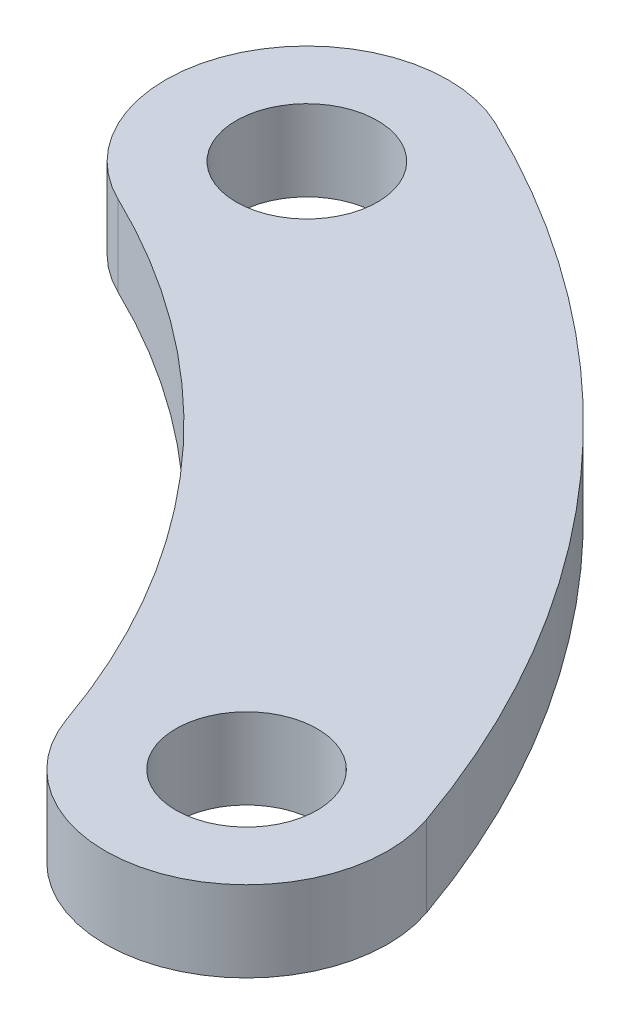
ISO-10303-21;
HEADER;
FILE_DESCRIPTION(('STEP AP214'),'2;1');
FILE_NAME('part.step','',(''),(''),'','','');
FILE_SCHEMA(('AUTOMOTIVE_DESIGN { 1 0 10303 214 1 1 1 1 }'));
ENDSEC;
DATA;
#1=APPLICATION_CONTEXT('core data for automotive mechanical design processes');
#2=APPLICATION_PROTOCOL_DEFINITION('international standard','automotive_design',2000,#1);
#3=PRODUCT_CONTEXT('',#1,'mechanical');
#4=PRODUCT('Part','Part','',(#3));
#5=PRODUCT_RELATED_PRODUCT_CATEGORY('part','',(#4));
#6=PRODUCT_DEFINITION_FORMATION('','',#4);
#7=PRODUCT_DEFINITION_CONTEXT('part definition',#1,'design');
#8=PRODUCT_DEFINITION('design','',#6,#7);
#9=PRODUCT_DEFINITION_SHAPE('','',#8);
#10=(LENGTH_UNIT() NAMED_UNIT(*) SI_UNIT(.MILLI.,.METRE.));
#11=(NAMED_UNIT(*) PLANE_ANGLE_UNIT() SI_UNIT($,.RADIAN.));
#12=(NAMED_UNIT(*) SI_UNIT($,.STERADIAN.) SOLID_ANGLE_UNIT());
#13=UNCERTAINTY_MEASURE_WITH_UNIT(LENGTH_MEASURE(1.E-05),#10,'distance_accuracy_value','');
#14=(GEOMETRIC_REPRESENTATION_CONTEXT(3) GLOBAL_UNCERTAINTY_ASSIGNED_CONTEXT((#13)) GLOBAL_UNIT_ASSIGNED_CONTEXT((#10,
#11,#12)) REPRESENTATION_CONTEXT('',''));
#15=CARTESIAN_POINT('',(0.,0.,0.));
#16=DIRECTION('',(0.,0.,1.));
#17=DIRECTION('',(1.,0.,0.));
#18=AXIS2_PLACEMENT_3D('',#15,#16,#17);
#19=CARTESIAN_POINT('',(11.4017185215984,4.,-3.97573134834832));
#20=DIRECTION('',(0.,1.,0.));
#21=DIRECTION('',(0.,0.,1.));
#22=AXIS2_PLACEMENT_3D('',#19,#20,#21);
#23=PLANE('',#22);
#24=CARTESIAN_POINT('',(10.5019317744189,4.,-21.7469981607911));
#25=DIRECTION('',(0.,1.,0.));
#26=DIRECTION('',(0.,0.,1.));
#27=AXIS2_PLACEMENT_3D('',#24,#25,#26);
#28=CIRCLE('',#27,1.75);
#29=CARTESIAN_POINT('',(10.5019317744189,4.,-19.9969981607911));
#30=VERTEX_POINT('',#29);
#31=EDGE_CURVE('E114',#30,#30,#28,.T.);
#32=ORIENTED_EDGE('',*,*,#31,.F.);
#33=EDGE_LOOP('',(#32));
#34=FACE_BOUND('',#33,.T.);
#35=CARTESIAN_POINT('',(22.8034370431968,4.,-7.95146269669664));
#36=DIRECTION('',(0.,1.,0.));
#37=DIRECTION('',(0.,0.,1.));
#38=AXIS2_PLACEMENT_3D('',#35,#36,#37);
#39=CIRCLE('',#38,3.5);
#40=CARTESIAN_POINT('',(19.4985910949074,4.,-6.79907679862466));
#41=VERTEX_POINT('',#40);
#42=CARTESIAN_POINT('',(26.1082829914862,4.,-9.10384859476862));
#43=VERTEX_POINT('',#42);
#44=EDGE_CURVE('E94',#41,#43,#39,.T.);
#45=ORIENTED_EDGE('',*,*,#44,.T.);
#46=CARTESIAN_POINT('',(0.,4.,0.));
#47=DIRECTION('',(0.,1.,0.));
#48=DIRECTION('',(0.,0.,1.));
#49=AXIS2_PLACEMENT_3D('',#46,#47,#48);
#50=CIRCLE('',#49,27.65);
#51=CARTESIAN_POINT('',(12.0239508721608,4.,-24.8987370246738));
#52=VERTEX_POINT('',#51);
#53=EDGE_CURVE('E89',#43,#52,#50,.T.);
#54=ORIENTED_EDGE('',*,*,#53,.T.);
#55=CARTESIAN_POINT('',(10.5019317744189,4.,-21.7469981607911));
#56=DIRECTION('',(0.,1.,0.));
#57=DIRECTION('',(0.,0.,1.));
#58=AXIS2_PLACEMENT_3D('',#55,#56,#57);
#59=CIRCLE('',#58,3.5);
#60=CARTESIAN_POINT('',(8.97991267667702,4.,-18.5952592969083));
#61=VERTEX_POINT('',#60);
#62=EDGE_CURVE('E92',#52,#61,#59,.T.);
#63=ORIENTED_EDGE('',*,*,#62,.T.);
#64=CARTESIAN_POINT('',(0.,4.,0.));
#65=DIRECTION('',(0.,-1.,0.));
#66=DIRECTION('',(0.,0.,1.));
#67=AXIS2_PLACEMENT_3D('',#64,#65,#66);
#68=CIRCLE('',#67,20.65);
#69=EDGE_CURVE('E59',#61,#41,#68,.T.);
#70=ORIENTED_EDGE('',*,*,#69,.T.);
#71=EDGE_LOOP('',(#45,#54,#63,#70));
#72=FACE_BOUND('',#71,.T.);
#73=CARTESIAN_POINT('',(22.8034370431968,4.,-7.95146269669664));
#74=DIRECTION('',(0.,1.,0.));
#75=DIRECTION('',(0.,0.,1.));
#76=AXIS2_PLACEMENT_3D('',#73,#74,#75);
#77=CIRCLE('',#76,1.75);
#78=CARTESIAN_POINT('',(22.8034370431968,4.,-6.20146269669664));
#79=VERTEX_POINT('',#78);
#80=EDGE_CURVE('E136',#79,#79,#77,.T.);
#81=ORIENTED_EDGE('',*,*,#80,.F.);
#82=EDGE_LOOP('',(#81));
#83=FACE_BOUND('',#82,.T.);
#84=ADVANCED_FACE('F41',(#34,#72,#83),#23,.T.);
#85=CARTESIAN_POINT('',(11.4017185215984,2.,-3.97573134834832));
#86=DIRECTION('',(0.,1.,0.));
#87=DIRECTION('',(0.,0.,1.));
#88=AXIS2_PLACEMENT_3D('',#85,#86,#87);
#89=PLANE('',#88);
#90=CARTESIAN_POINT('',(22.8034370431968,2.,-7.95146269669664));
#91=DIRECTION('',(0.,1.,0.));
#92=DIRECTION('',(0.,0.,1.));
#93=AXIS2_PLACEMENT_3D('',#90,#91,#92);
#94=CIRCLE('',#93,3.5);
#95=CARTESIAN_POINT('',(19.4985910949074,2.,-6.79907679862466));
#96=VERTEX_POINT('',#95);
#97=CARTESIAN_POINT('',(26.1082829914862,2.,-9.10384859476862));
#98=VERTEX_POINT('',#97);
#99=EDGE_CURVE('E110',#96,#98,#94,.T.);
#100=ORIENTED_EDGE('',*,*,#99,.F.);
#101=CARTESIAN_POINT('',(0.,2.,0.));
#102=DIRECTION('',(0.,-1.,0.));
#103=DIRECTION('',(0.,0.,1.));
#104=AXIS2_PLACEMENT_3D('',#101,#102,#103);
#105=CIRCLE('',#104,20.65);
#106=CARTESIAN_POINT('',(8.97991267667702,2.,-18.5952592969083));
#107=VERTEX_POINT('',#106);
#108=EDGE_CURVE('E82',#107,#96,#105,.T.);
#109=ORIENTED_EDGE('',*,*,#108,.F.);
#110=CARTESIAN_POINT('',(10.5019317744189,2.,-21.7469981607911));
#111=DIRECTION('',(0.,1.,0.));
#112=DIRECTION('',(0.,0.,1.));
#113=AXIS2_PLACEMENT_3D('',#110,#111,#112);
#114=CIRCLE('',#113,3.5);
#115=CARTESIAN_POINT('',(12.0239508721608,2.,-24.8987370246738));
#116=VERTEX_POINT('',#115);
#117=EDGE_CURVE('E76',#116,#107,#114,.T.);
#118=ORIENTED_EDGE('',*,*,#117,.F.);
#119=CARTESIAN_POINT('',(0.,2.,0.));
#120=DIRECTION('',(0.,1.,0.));
#121=DIRECTION('',(0.,0.,1.));
#122=AXIS2_PLACEMENT_3D('',#119,#120,#121);
#123=CIRCLE('',#122,27.65);
#124=EDGE_CURVE('E99',#98,#116,#123,.T.);
#125=ORIENTED_EDGE('',*,*,#124,.F.);
#126=EDGE_LOOP('',(#100,#109,#118,#125));
#127=FACE_BOUND('',#126,.T.);
#128=CARTESIAN_POINT('',(10.5019317744189,2.,-21.7469981607911));
#129=DIRECTION('',(0.,1.,0.));
#130=DIRECTION('',(0.,0.,1.));
#131=AXIS2_PLACEMENT_3D('',#128,#129,#130);
#132=CIRCLE('',#131,1.75);
#133=CARTESIAN_POINT('',(10.5019317744189,2.,-19.9969981607911));
#134=VERTEX_POINT('',#133);
#135=EDGE_CURVE('E132',#134,#134,#132,.T.);
#136=ORIENTED_EDGE('',*,*,#135,.T.);
#137=EDGE_LOOP('',(#136));
#138=FACE_BOUND('',#137,.T.);
#139=CARTESIAN_POINT('',(22.8034370431968,2.,-7.95146269669664));
#140=DIRECTION('',(0.,1.,0.));
#141=DIRECTION('',(0.,0.,1.));
#142=AXIS2_PLACEMENT_3D('',#139,#140,#141);
#143=CIRCLE('',#142,1.75);
#144=CARTESIAN_POINT('',(22.8034370431968,2.,-6.20146269669664));
#145=VERTEX_POINT('',#144);
#146=EDGE_CURVE('E140',#145,#145,#143,.T.);
#147=ORIENTED_EDGE('',*,*,#146,.T.);
#148=EDGE_LOOP('',(#147));
#149=FACE_BOUND('',#148,.T.);
#150=ADVANCED_FACE('F127',(#127,#138,#149),#89,.F.);
#151=CARTESIAN_POINT('',(22.8034370431968,4.,-7.95146269669664));
#152=DIRECTION('',(0.,-1.,0.));
#153=DIRECTION('',(0.,0.,-1.));
#154=AXIS2_PLACEMENT_3D('',#151,#152,#153);
#155=CYLINDRICAL_SURFACE('',#154,3.5);
#156=ORIENTED_EDGE('',*,*,#99,.T.);
#157=DIRECTION('',(0.,-1.,0.));
#158=VECTOR('',#157,1.);
#159=CARTESIAN_POINT('',(26.1082829914862,4.,-9.10384859476862));
#160=LINE('',#159,#158);
#161=EDGE_CURVE('E11',#43,#98,#160,.T.);
#162=ORIENTED_EDGE('',*,*,#161,.F.);
#163=ORIENTED_EDGE('',*,*,#44,.F.);
#164=DIRECTION('',(0.,-1.,0.));
#165=VECTOR('',#164,1.);
#166=CARTESIAN_POINT('',(19.4985910949074,4.,-6.79907679862466));
#167=LINE('',#166,#165);
#168=EDGE_CURVE('E106',#41,#96,#167,.T.);
#169=ORIENTED_EDGE('',*,*,#168,.T.);
#170=EDGE_LOOP('',(#156,#162,#163,#169));
#171=FACE_BOUND('',#170,.T.);
#172=ADVANCED_FACE('F43',(#171),#155,.T.);
#173=CARTESIAN_POINT('',(0.,4.,0.));
#174=DIRECTION('',(0.,-1.,0.));
#175=DIRECTION('',(0.,0.,-1.));
#176=AXIS2_PLACEMENT_3D('',#173,#174,#175);
#177=CYLINDRICAL_SURFACE('',#176,27.65);
#178=ORIENTED_EDGE('',*,*,#124,.T.);
#179=DIRECTION('',(0.,-1.,0.));
#180=VECTOR('',#179,1.);
#181=CARTESIAN_POINT('',(12.0239508721608,4.,-24.8987370246738));
#182=LINE('',#181,#180);
#183=EDGE_CURVE('E51',#52,#116,#182,.T.);
#184=ORIENTED_EDGE('',*,*,#183,.F.);
#185=ORIENTED_EDGE('',*,*,#53,.F.);
#186=ORIENTED_EDGE('',*,*,#161,.T.);
#187=EDGE_LOOP('',(#178,#184,#185,#186));
#188=FACE_BOUND('',#187,.T.);
#189=ADVANCED_FACE('F98',(#188),#177,.T.);
#190=CARTESIAN_POINT('',(10.5019317744189,4.,-21.7469981607911));
#191=DIRECTION('',(0.,-1.,0.));
#192=DIRECTION('',(0.,0.,-1.));
#193=AXIS2_PLACEMENT_3D('',#190,#191,#192);
#194=CYLINDRICAL_SURFACE('',#193,3.5);
#195=ORIENTED_EDGE('',*,*,#117,.T.);
#196=DIRECTION('',(0.,-1.,0.));
#197=VECTOR('',#196,1.);
#198=CARTESIAN_POINT('',(8.97991267667702,4.,-18.5952592969083));
#199=LINE('',#198,#197);
#200=EDGE_CURVE('E101',#61,#107,#199,.T.);
#201=ORIENTED_EDGE('',*,*,#200,.F.);
#202=ORIENTED_EDGE('',*,*,#62,.F.);
#203=ORIENTED_EDGE('',*,*,#183,.T.);
#204=EDGE_LOOP('',(#195,#201,#202,#203));
#205=FACE_BOUND('',#204,.T.);
#206=ADVANCED_FACE('F102',(#205),#194,.T.);
#207=CARTESIAN_POINT('',(0.,4.,0.));
#208=DIRECTION('',(0.,-1.,0.));
#209=DIRECTION('',(0.,0.,-1.));
#210=AXIS2_PLACEMENT_3D('',#207,#208,#209);
#211=CYLINDRICAL_SURFACE('',#210,20.65);
#212=ORIENTED_EDGE('',*,*,#108,.T.);
#213=ORIENTED_EDGE('',*,*,#168,.F.);
#214=ORIENTED_EDGE('',*,*,#69,.F.);
#215=ORIENTED_EDGE('',*,*,#200,.T.);
#216=EDGE_LOOP('',(#212,#213,#214,#215));
#217=FACE_BOUND('',#216,.T.);
#218=ADVANCED_FACE('F124',(#217),#211,.F.);
#219=CARTESIAN_POINT('',(10.5019317744189,4.,-21.7469981607911));
#220=DIRECTION('',(0.,-1.,0.));
#221=DIRECTION('',(0.,0.,-1.));
#222=AXIS2_PLACEMENT_3D('',#219,#220,#221);
#223=CYLINDRICAL_SURFACE('',#222,1.75);
#224=ORIENTED_EDGE('',*,*,#31,.T.);
#225=EDGE_LOOP('',(#224));
#226=FACE_BOUND('',#225,.T.);
#227=ORIENTED_EDGE('',*,*,#135,.F.);
#228=EDGE_LOOP('',(#227));
#229=FACE_BOUND('',#228,.T.);
#230=ADVANCED_FACE('F159',(#226,#229),#223,.F.);
#231=CARTESIAN_POINT('',(22.8034370431968,4.,-7.95146269669664));
#232=DIRECTION('',(0.,-1.,0.));
#233=DIRECTION('',(0.,0.,-1.));
#234=AXIS2_PLACEMENT_3D('',#231,#232,#233);
#235=CYLINDRICAL_SURFACE('',#234,1.75);
#236=ORIENTED_EDGE('',*,*,#80,.T.);
#237=EDGE_LOOP('',(#236));
#238=FACE_BOUND('',#237,.T.);
#239=ORIENTED_EDGE('',*,*,#146,.F.);
#240=EDGE_LOOP('',(#239));
#241=FACE_BOUND('',#240,.T.);
#242=ADVANCED_FACE('F148',(#238,#241),#235,.F.);
#243=CLOSED_SHELL('',(#84,#150,#172,#189,#206,#218,#230,#242));
#244=MANIFOLD_SOLID_BREP('B2',#243);
#245=ADVANCED_BREP_SHAPE_REPRESENTATION('',(#18,#244),#14);
#246=SHAPE_DEFINITION_REPRESENTATION(#9,#245);
ENDSEC;
END-ISO-10303-21;
